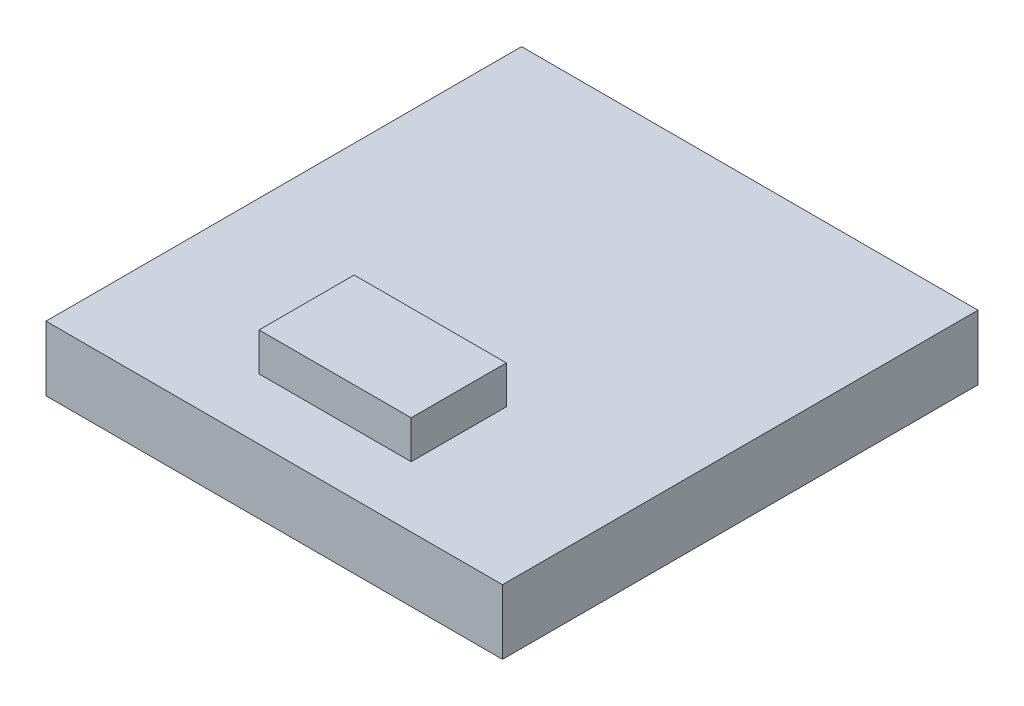
ISO-10303-21;
HEADER;
FILE_DESCRIPTION(('STEP AP214'),'2;1');
FILE_NAME('part.step','',(''),(''),'','','');
FILE_SCHEMA(('AUTOMOTIVE_DESIGN { 1 0 10303 214 1 1 1 1 }'));
ENDSEC;
DATA;
#1=APPLICATION_CONTEXT('core data for automotive mechanical design processes');
#2=APPLICATION_PROTOCOL_DEFINITION('international standard','automotive_design',2000,#1);
#3=PRODUCT_CONTEXT('',#1,'mechanical');
#4=PRODUCT('Part','Part','',(#3));
#5=PRODUCT_RELATED_PRODUCT_CATEGORY('part','',(#4));
#6=PRODUCT_DEFINITION_FORMATION('','',#4);
#7=PRODUCT_DEFINITION_CONTEXT('part definition',#1,'design');
#8=PRODUCT_DEFINITION('design','',#6,#7);
#9=PRODUCT_DEFINITION_SHAPE('','',#8);
#10=(LENGTH_UNIT() NAMED_UNIT(*) SI_UNIT(.MILLI.,.METRE.));
#11=(NAMED_UNIT(*) PLANE_ANGLE_UNIT() SI_UNIT($,.RADIAN.));
#12=(NAMED_UNIT(*) SI_UNIT($,.STERADIAN.) SOLID_ANGLE_UNIT());
#13=UNCERTAINTY_MEASURE_WITH_UNIT(LENGTH_MEASURE(1.E-05),#10,'distance_accuracy_value','');
#14=(GEOMETRIC_REPRESENTATION_CONTEXT(3) GLOBAL_UNCERTAINTY_ASSIGNED_CONTEXT((#13)) GLOBAL_UNIT_ASSIGNED_CONTEXT((#10,
#11,#12)) REPRESENTATION_CONTEXT('',''));
#15=CARTESIAN_POINT('',(0.,0.,0.));
#16=DIRECTION('',(0.,0.,1.));
#17=DIRECTION('',(1.,0.,0.));
#18=AXIS2_PLACEMENT_3D('',#15,#16,#17);
#19=CARTESIAN_POINT('',(0.,0.85,0.));
#20=DIRECTION('',(0.,1.,0.));
#21=DIRECTION('',(0.,0.,1.));
#22=AXIS2_PLACEMENT_3D('',#19,#20,#21);
#23=PLANE('',#22);
#24=DIRECTION('',(0.,0.,1.));
#25=VECTOR('',#24,1.);
#26=CARTESIAN_POINT('',(-3.,0.85,-3.125));
#27=LINE('',#26,#25);
#28=CARTESIAN_POINT('',(-3.,0.85,-3.125));
#29=VERTEX_POINT('',#28);
#30=CARTESIAN_POINT('',(-3.,0.85,3.125));
#31=VERTEX_POINT('',#30);
#32=EDGE_CURVE('E141',#29,#31,#27,.T.);
#33=ORIENTED_EDGE('',*,*,#32,.T.);
#34=DIRECTION('',(1.,0.,0.));
#35=VECTOR('',#34,1.);
#36=CARTESIAN_POINT('',(-3.,0.85,3.125));
#37=LINE('',#36,#35);
#38=CARTESIAN_POINT('',(3.,0.85,3.125));
#39=VERTEX_POINT('',#38);
#40=EDGE_CURVE('E86',#31,#39,#37,.T.);
#41=ORIENTED_EDGE('',*,*,#40,.T.);
#42=DIRECTION('',(0.,0.,-1.));
#43=VECTOR('',#42,1.);
#44=CARTESIAN_POINT('',(3.,0.85,-3.125));
#45=LINE('',#44,#43);
#46=CARTESIAN_POINT('',(3.,0.85,-3.125));
#47=VERTEX_POINT('',#46);
#48=EDGE_CURVE('E144',#39,#47,#45,.T.);
#49=ORIENTED_EDGE('',*,*,#48,.T.);
#50=DIRECTION('',(-1.,0.,0.));
#51=VECTOR('',#50,1.);
#52=CARTESIAN_POINT('',(-3.,0.85,-3.125));
#53=LINE('',#52,#51);
#54=EDGE_CURVE('E58',#47,#29,#53,.T.);
#55=ORIENTED_EDGE('',*,*,#54,.T.);
#56=EDGE_LOOP('',(#33,#41,#49,#55));
#57=FACE_BOUND('',#56,.T.);
#58=DIRECTION('',(1.,0.,0.));
#59=VECTOR('',#58,1.);
#60=CARTESIAN_POINT('',(-1.,0.85,2.325));
#61=LINE('',#60,#59);
#62=CARTESIAN_POINT('',(-1.,0.85,2.325));
#63=VERTEX_POINT('',#62);
#64=CARTESIAN_POINT('',(1.,0.85,2.325));
#65=VERTEX_POINT('',#64);
#66=EDGE_CURVE('E264',#63,#65,#61,.T.);
#67=ORIENTED_EDGE('',*,*,#66,.F.);
#68=DIRECTION('',(0.,0.,1.));
#69=VECTOR('',#68,1.);
#70=CARTESIAN_POINT('',(-1.,0.85,2.325));
#71=LINE('',#70,#69);
#72=CARTESIAN_POINT('',(-1.,0.85,1.075));
#73=VERTEX_POINT('',#72);
#74=EDGE_CURVE('E131',#73,#63,#71,.T.);
#75=ORIENTED_EDGE('',*,*,#74,.F.);
#76=DIRECTION('',(-1.,0.,0.));
#77=VECTOR('',#76,1.);
#78=CARTESIAN_POINT('',(-1.,0.85,1.075));
#79=LINE('',#78,#77);
#80=CARTESIAN_POINT('',(1.,0.85,1.075));
#81=VERTEX_POINT('',#80);
#82=EDGE_CURVE('E127',#81,#73,#79,.T.);
#83=ORIENTED_EDGE('',*,*,#82,.F.);
#84=DIRECTION('',(0.,0.,-1.));
#85=VECTOR('',#84,1.);
#86=CARTESIAN_POINT('',(1.,0.85,2.325));
#87=LINE('',#86,#85);
#88=EDGE_CURVE('E261',#65,#81,#87,.T.);
#89=ORIENTED_EDGE('',*,*,#88,.F.);
#90=EDGE_LOOP('',(#67,#75,#83,#89));
#91=FACE_BOUND('',#90,.T.);
#92=ADVANCED_FACE('F34',(#57,#91),#23,.T.);
#93=CARTESIAN_POINT('',(-3.,0.85,-3.125));
#94=DIRECTION('',(1.,0.,0.));
#95=DIRECTION('',(0.,0.,-1.));
#96=AXIS2_PLACEMENT_3D('',#93,#94,#95);
#97=PLANE('',#96);
#98=DIRECTION('',(0.,0.,1.));
#99=VECTOR('',#98,1.);
#100=CARTESIAN_POINT('',(-3.,0.,-3.125));
#101=LINE('',#100,#99);
#102=CARTESIAN_POINT('',(-3.,0.,-3.125));
#103=VERTEX_POINT('',#102);
#104=CARTESIAN_POINT('',(-3.,0.,3.125));
#105=VERTEX_POINT('',#104);
#106=EDGE_CURVE('E133',#103,#105,#101,.T.);
#107=ORIENTED_EDGE('',*,*,#106,.T.);
#108=DIRECTION('',(0.,-1.,0.));
#109=VECTOR('',#108,1.);
#110=CARTESIAN_POINT('',(-3.,0.85,3.125));
#111=LINE('',#110,#109);
#112=EDGE_CURVE('E11',#31,#105,#111,.T.);
#113=ORIENTED_EDGE('',*,*,#112,.F.);
#114=ORIENTED_EDGE('',*,*,#32,.F.);
#115=DIRECTION('',(0.,-1.,0.));
#116=VECTOR('',#115,1.);
#117=CARTESIAN_POINT('',(-3.,0.85,-3.125));
#118=LINE('',#117,#116);
#119=EDGE_CURVE('E146',#29,#103,#118,.T.);
#120=ORIENTED_EDGE('',*,*,#119,.T.);
#121=EDGE_LOOP('',(#107,#113,#114,#120));
#122=FACE_BOUND('',#121,.T.);
#123=ADVANCED_FACE('F36',(#122),#97,.F.);
#124=CARTESIAN_POINT('',(-3.,0.85,3.125));
#125=DIRECTION('',(0.,0.,-1.));
#126=DIRECTION('',(-1.,0.,0.));
#127=AXIS2_PLACEMENT_3D('',#124,#125,#126);
#128=PLANE('',#127);
#129=DIRECTION('',(1.,0.,0.));
#130=VECTOR('',#129,1.);
#131=CARTESIAN_POINT('',(-3.,0.,3.125));
#132=LINE('',#131,#130);
#133=CARTESIAN_POINT('',(3.,0.,3.125));
#134=VERTEX_POINT('',#133);
#135=EDGE_CURVE('E136',#105,#134,#132,.T.);
#136=ORIENTED_EDGE('',*,*,#135,.T.);
#137=DIRECTION('',(0.,-1.,0.));
#138=VECTOR('',#137,1.);
#139=CARTESIAN_POINT('',(3.,0.85,3.125));
#140=LINE('',#139,#138);
#141=EDGE_CURVE('E42',#39,#134,#140,.T.);
#142=ORIENTED_EDGE('',*,*,#141,.F.);
#143=ORIENTED_EDGE('',*,*,#40,.F.);
#144=ORIENTED_EDGE('',*,*,#112,.T.);
#145=EDGE_LOOP('',(#136,#142,#143,#144));
#146=FACE_BOUND('',#145,.T.);
#147=ADVANCED_FACE('F174',(#146),#128,.F.);
#148=CARTESIAN_POINT('',(3.,0.85,-3.125));
#149=DIRECTION('',(-1.,0.,0.));
#150=DIRECTION('',(0.,0.,1.));
#151=AXIS2_PLACEMENT_3D('',#148,#149,#150);
#152=PLANE('',#151);
#153=DIRECTION('',(0.,0.,-1.));
#154=VECTOR('',#153,1.);
#155=CARTESIAN_POINT('',(3.,0.,-3.125));
#156=LINE('',#155,#154);
#157=CARTESIAN_POINT('',(3.,0.,-3.125));
#158=VERTEX_POINT('',#157);
#159=EDGE_CURVE('E149',#134,#158,#156,.T.);
#160=ORIENTED_EDGE('',*,*,#159,.T.);
#161=DIRECTION('',(0.,-1.,0.));
#162=VECTOR('',#161,1.);
#163=CARTESIAN_POINT('',(3.,0.85,-3.125));
#164=LINE('',#163,#162);
#165=EDGE_CURVE('E153',#47,#158,#164,.T.);
#166=ORIENTED_EDGE('',*,*,#165,.F.);
#167=ORIENTED_EDGE('',*,*,#48,.F.);
#168=ORIENTED_EDGE('',*,*,#141,.T.);
#169=EDGE_LOOP('',(#160,#166,#167,#168));
#170=FACE_BOUND('',#169,.T.);
#171=ADVANCED_FACE('F158',(#170),#152,.F.);
#172=CARTESIAN_POINT('',(-3.,0.85,-3.125));
#173=DIRECTION('',(0.,0.,1.));
#174=DIRECTION('',(1.,0.,0.));
#175=AXIS2_PLACEMENT_3D('',#172,#173,#174);
#176=PLANE('',#175);
#177=DIRECTION('',(-1.,0.,0.));
#178=VECTOR('',#177,1.);
#179=CARTESIAN_POINT('',(-3.,0.,-3.125));
#180=LINE('',#179,#178);
#181=EDGE_CURVE('E79',#158,#103,#180,.T.);
#182=ORIENTED_EDGE('',*,*,#181,.T.);
#183=ORIENTED_EDGE('',*,*,#119,.F.);
#184=ORIENTED_EDGE('',*,*,#54,.F.);
#185=ORIENTED_EDGE('',*,*,#165,.T.);
#186=EDGE_LOOP('',(#182,#183,#184,#185));
#187=FACE_BOUND('',#186,.T.);
#188=ADVANCED_FACE('F166',(#187),#176,.F.);
#189=CARTESIAN_POINT('',(0.,0.,0.));
#190=DIRECTION('',(0.,1.,0.));
#191=DIRECTION('',(0.,0.,1.));
#192=AXIS2_PLACEMENT_3D('',#189,#190,#191);
#193=PLANE('',#192);
#194=ORIENTED_EDGE('',*,*,#106,.F.);
#195=ORIENTED_EDGE('',*,*,#181,.F.);
#196=ORIENTED_EDGE('',*,*,#159,.F.);
#197=ORIENTED_EDGE('',*,*,#135,.F.);
#198=EDGE_LOOP('',(#194,#195,#196,#197));
#199=FACE_BOUND('',#198,.T.);
#200=ADVANCED_FACE('F162',(#199),#193,.F.);
#201=CARTESIAN_POINT('',(-1.,1.35,2.325));
#202=DIRECTION('',(1.,0.,0.));
#203=DIRECTION('',(0.,0.,-1.));
#204=AXIS2_PLACEMENT_3D('',#201,#202,#203);
#205=PLANE('',#204);
#206=ORIENTED_EDGE('',*,*,#74,.T.);
#207=DIRECTION('',(0.,-1.,0.));
#208=VECTOR('',#207,1.);
#209=CARTESIAN_POINT('',(-1.,1.35,2.325));
#210=LINE('',#209,#208);
#211=CARTESIAN_POINT('',(-1.,1.35,2.325));
#212=VERTEX_POINT('',#211);
#213=EDGE_CURVE('E112',#212,#63,#210,.T.);
#214=ORIENTED_EDGE('',*,*,#213,.F.);
#215=DIRECTION('',(0.,0.,1.));
#216=VECTOR('',#215,1.);
#217=CARTESIAN_POINT('',(-1.,1.35,2.325));
#218=LINE('',#217,#216);
#219=CARTESIAN_POINT('',(-1.,1.35,1.075));
#220=VERTEX_POINT('',#219);
#221=EDGE_CURVE('E119',#220,#212,#218,.T.);
#222=ORIENTED_EDGE('',*,*,#221,.F.);
#223=DIRECTION('',(0.,-1.,0.));
#224=VECTOR('',#223,1.);
#225=CARTESIAN_POINT('',(-1.,1.35,1.075));
#226=LINE('',#225,#224);
#227=EDGE_CURVE('E259',#220,#73,#226,.T.);
#228=ORIENTED_EDGE('',*,*,#227,.T.);
#229=EDGE_LOOP('',(#206,#214,#222,#228));
#230=FACE_BOUND('',#229,.T.);
#231=ADVANCED_FACE('F129',(#230),#205,.F.);
#232=CARTESIAN_POINT('',(-1.,1.35,2.325));
#233=DIRECTION('',(0.,0.,-1.));
#234=DIRECTION('',(-1.,0.,0.));
#235=AXIS2_PLACEMENT_3D('',#232,#233,#234);
#236=PLANE('',#235);
#237=ORIENTED_EDGE('',*,*,#66,.T.);
#238=DIRECTION('',(0.,-1.,0.));
#239=VECTOR('',#238,1.);
#240=CARTESIAN_POINT('',(1.,1.35,2.325));
#241=LINE('',#240,#239);
#242=CARTESIAN_POINT('',(1.,1.35,2.325));
#243=VERTEX_POINT('',#242);
#244=EDGE_CURVE('E115',#243,#65,#241,.T.);
#245=ORIENTED_EDGE('',*,*,#244,.F.);
#246=DIRECTION('',(1.,0.,0.));
#247=VECTOR('',#246,1.);
#248=CARTESIAN_POINT('',(-1.,1.35,2.325));
#249=LINE('',#248,#247);
#250=EDGE_CURVE('E108',#212,#243,#249,.T.);
#251=ORIENTED_EDGE('',*,*,#250,.F.);
#252=ORIENTED_EDGE('',*,*,#213,.T.);
#253=EDGE_LOOP('',(#237,#245,#251,#252));
#254=FACE_BOUND('',#253,.T.);
#255=ADVANCED_FACE('F110',(#254),#236,.F.);
#256=CARTESIAN_POINT('',(1.,1.35,2.325));
#257=DIRECTION('',(-1.,0.,0.));
#258=DIRECTION('',(0.,0.,1.));
#259=AXIS2_PLACEMENT_3D('',#256,#257,#258);
#260=PLANE('',#259);
#261=ORIENTED_EDGE('',*,*,#88,.T.);
#262=DIRECTION('',(0.,-1.,0.));
#263=VECTOR('',#262,1.);
#264=CARTESIAN_POINT('',(1.,1.35,1.075));
#265=LINE('',#264,#263);
#266=CARTESIAN_POINT('',(1.,1.35,1.075));
#267=VERTEX_POINT('',#266);
#268=EDGE_CURVE('E49',#267,#81,#265,.T.);
#269=ORIENTED_EDGE('',*,*,#268,.F.);
#270=DIRECTION('',(0.,0.,-1.));
#271=VECTOR('',#270,1.);
#272=CARTESIAN_POINT('',(1.,1.35,2.325));
#273=LINE('',#272,#271);
#274=EDGE_CURVE('E118',#243,#267,#273,.T.);
#275=ORIENTED_EDGE('',*,*,#274,.F.);
#276=ORIENTED_EDGE('',*,*,#244,.T.);
#277=EDGE_LOOP('',(#261,#269,#275,#276));
#278=FACE_BOUND('',#277,.T.);
#279=ADVANCED_FACE('F187',(#278),#260,.F.);
#280=CARTESIAN_POINT('',(-1.,1.35,1.075));
#281=DIRECTION('',(0.,0.,1.));
#282=DIRECTION('',(1.,0.,0.));
#283=AXIS2_PLACEMENT_3D('',#280,#281,#282);
#284=PLANE('',#283);
#285=ORIENTED_EDGE('',*,*,#82,.T.);
#286=ORIENTED_EDGE('',*,*,#227,.F.);
#287=DIRECTION('',(-1.,0.,0.));
#288=VECTOR('',#287,1.);
#289=CARTESIAN_POINT('',(-1.,1.35,1.075));
#290=LINE('',#289,#288);
#291=EDGE_CURVE('E123',#267,#220,#290,.T.);
#292=ORIENTED_EDGE('',*,*,#291,.F.);
#293=ORIENTED_EDGE('',*,*,#268,.T.);
#294=EDGE_LOOP('',(#285,#286,#292,#293));
#295=FACE_BOUND('',#294,.T.);
#296=ADVANCED_FACE('F190',(#295),#284,.F.);
#297=CARTESIAN_POINT('',(0.,1.35,0.));
#298=DIRECTION('',(0.,-1.,0.));
#299=DIRECTION('',(0.,0.,-1.));
#300=AXIS2_PLACEMENT_3D('',#297,#298,#299);
#301=PLANE('',#300);
#302=ORIENTED_EDGE('',*,*,#221,.T.);
#303=ORIENTED_EDGE('',*,*,#250,.T.);
#304=ORIENTED_EDGE('',*,*,#274,.T.);
#305=ORIENTED_EDGE('',*,*,#291,.T.);
#306=EDGE_LOOP('',(#302,#303,#304,#305));
#307=FACE_BOUND('',#306,.T.);
#308=ADVANCED_FACE('F122',(#307),#301,.F.);
#309=CLOSED_SHELL('',(#92,#123,#147,#171,#188,#200,#231,#255,#279,#296,#308));
#310=MANIFOLD_SOLID_BREP('B2',#309);
#311=ADVANCED_BREP_SHAPE_REPRESENTATION('',(#18,#310),#14);
#312=SHAPE_DEFINITION_REPRESENTATION(#9,#311);
ENDSEC;
END-ISO-10303-21;
